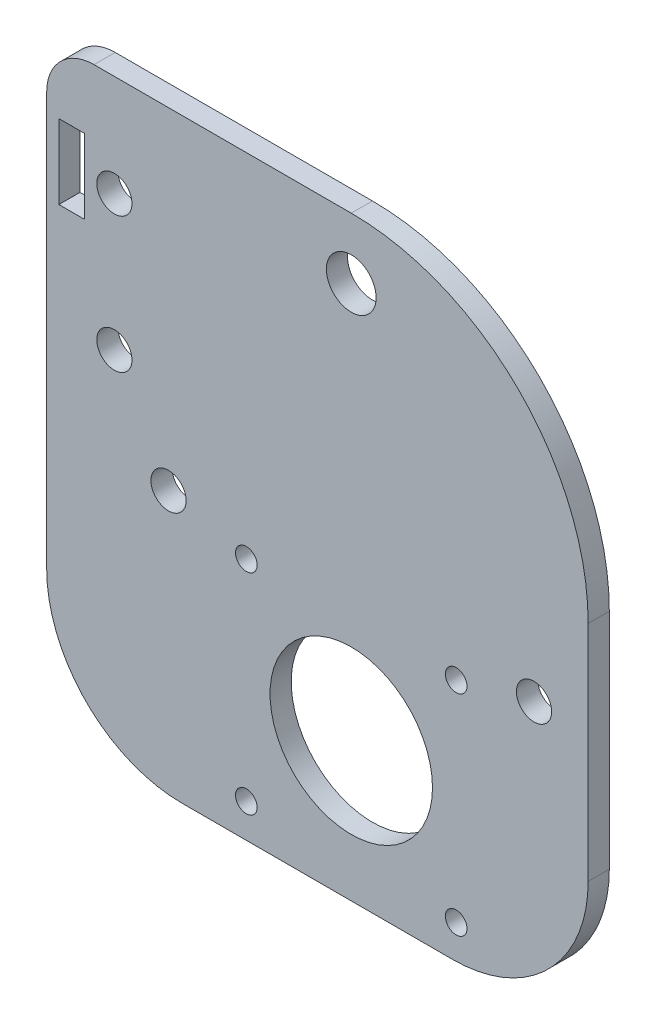
ISO-10303-21;
HEADER;
FILE_DESCRIPTION(('STEP AP214'),'2;1');
FILE_NAME('part.step','',(''),(''),'','','');
FILE_SCHEMA(('AUTOMOTIVE_DESIGN { 1 0 10303 214 1 1 1 1 }'));
ENDSEC;
DATA;
#1=APPLICATION_CONTEXT('core data for automotive mechanical design processes');
#2=APPLICATION_PROTOCOL_DEFINITION('international standard','automotive_design',2000,#1);
#3=PRODUCT_CONTEXT('',#1,'mechanical');
#4=PRODUCT('Part','Part','',(#3));
#5=PRODUCT_RELATED_PRODUCT_CATEGORY('part','',(#4));
#6=PRODUCT_DEFINITION_FORMATION('','',#4);
#7=PRODUCT_DEFINITION_CONTEXT('part definition',#1,'design');
#8=PRODUCT_DEFINITION('design','',#6,#7);
#9=PRODUCT_DEFINITION_SHAPE('','',#8);
#10=(LENGTH_UNIT() NAMED_UNIT(*) SI_UNIT(.MILLI.,.METRE.));
#11=(NAMED_UNIT(*) PLANE_ANGLE_UNIT() SI_UNIT($,.RADIAN.));
#12=(NAMED_UNIT(*) SI_UNIT($,.STERADIAN.) SOLID_ANGLE_UNIT());
#13=UNCERTAINTY_MEASURE_WITH_UNIT(LENGTH_MEASURE(1.E-05),#10,'distance_accuracy_value','');
#14=(GEOMETRIC_REPRESENTATION_CONTEXT(3) GLOBAL_UNCERTAINTY_ASSIGNED_CONTEXT((#13)) GLOBAL_UNIT_ASSIGNED_CONTEXT((#10,
#11,#12)) REPRESENTATION_CONTEXT('',''));
#15=CARTESIAN_POINT('',(0.,0.,0.));
#16=DIRECTION('',(0.,0.,1.));
#17=DIRECTION('',(1.,0.,0.));
#18=AXIS2_PLACEMENT_3D('',#15,#16,#17);
#19=CARTESIAN_POINT('',(45.,53.,3.125));
#20=DIRECTION('',(0.,0.,1.));
#21=DIRECTION('',(1.,0.,0.));
#22=AXIS2_PLACEMENT_3D('',#19,#20,#21);
#23=PLANE('',#22);
#24=CARTESIAN_POINT('',(72.,39.,3.125));
#25=DIRECTION('',(0.,0.,1.));
#26=DIRECTION('',(1.,0.,0.));
#27=AXIS2_PLACEMENT_3D('',#24,#25,#26);
#28=CIRCLE('',#27,2.60000000000002);
#29=CARTESIAN_POINT('',(74.6,39.,3.125));
#30=VERTEX_POINT('',#29);
#31=EDGE_CURVE('E159',#30,#30,#28,.T.);
#32=ORIENTED_EDGE('',*,*,#31,.F.);
#33=EDGE_LOOP('',(#32));
#34=FACE_BOUND('',#33,.T.);
#35=CARTESIAN_POINT('',(29.5,36.,3.125));
#36=DIRECTION('',(0.,0.,1.));
#37=DIRECTION('',(1.,0.,0.));
#38=AXIS2_PLACEMENT_3D('',#35,#36,#37);
#39=CIRCLE('',#38,1.59999999999999);
#40=CARTESIAN_POINT('',(31.1,36.,3.125));
#41=VERTEX_POINT('',#40);
#42=EDGE_CURVE('E171',#41,#41,#39,.T.);
#43=ORIENTED_EDGE('',*,*,#42,.F.);
#44=EDGE_LOOP('',(#43));
#45=FACE_BOUND('',#44,.T.);
#46=CARTESIAN_POINT('',(45.,79.,3.125));
#47=DIRECTION('',(0.,0.,1.));
#48=DIRECTION('',(1.,0.,0.));
#49=AXIS2_PLACEMENT_3D('',#46,#47,#48);
#50=CIRCLE('',#49,3.675);
#51=CARTESIAN_POINT('',(48.675,79.,3.125));
#52=VERTEX_POINT('',#51);
#53=EDGE_CURVE('E183',#52,#52,#50,.T.);
#54=ORIENTED_EDGE('',*,*,#53,.F.);
#55=EDGE_LOOP('',(#54));
#56=FACE_BOUND('',#55,.T.);
#57=CARTESIAN_POINT('',(60.5,36.,3.125));
#58=DIRECTION('',(0.,0.,1.));
#59=DIRECTION('',(1.,0.,0.));
#60=AXIS2_PLACEMENT_3D('',#57,#58,#59);
#61=CIRCLE('',#60,1.59999999999998);
#62=CARTESIAN_POINT('',(62.1,36.,3.125));
#63=VERTEX_POINT('',#62);
#64=EDGE_CURVE('E195',#63,#63,#61,.T.);
#65=ORIENTED_EDGE('',*,*,#64,.F.);
#66=EDGE_LOOP('',(#65));
#67=FACE_BOUND('',#66,.T.);
#68=CARTESIAN_POINT('',(45.,20.5,3.125));
#69=DIRECTION('',(0.,0.,1.));
#70=DIRECTION('',(1.,0.,0.));
#71=AXIS2_PLACEMENT_3D('',#68,#69,#70);
#72=CIRCLE('',#71,12.);
#73=CARTESIAN_POINT('',(57.,20.5,3.125));
#74=VERTEX_POINT('',#73);
#75=EDGE_CURVE('E207',#74,#74,#72,.T.);
#76=ORIENTED_EDGE('',*,*,#75,.F.);
#77=EDGE_LOOP('',(#76));
#78=FACE_BOUND('',#77,.T.);
#79=CARTESIAN_POINT('',(45.,53.,3.125));
#80=DIRECTION('',(0.,0.,1.));
#81=DIRECTION('',(1.,0.,0.));
#82=AXIS2_PLACEMENT_3D('',#79,#80,#81);
#83=CIRCLE('',#82,35.);
#84=CARTESIAN_POINT('',(80.,53.,3.125));
#85=VERTEX_POINT('',#84);
#86=CARTESIAN_POINT('',(45.,88.,3.125));
#87=VERTEX_POINT('',#86);
#88=EDGE_CURVE('E219',#85,#87,#83,.T.);
#89=ORIENTED_EDGE('',*,*,#88,.T.);
#90=DIRECTION('',(-1.,0.,0.));
#91=VECTOR('',#90,1.);
#92=CARTESIAN_POINT('',(45.,88.,3.125));
#93=LINE('',#92,#91);
#94=CARTESIAN_POINT('',(7.,88.,3.125));
#95=VERTEX_POINT('',#94);
#96=EDGE_CURVE('E222',#87,#95,#93,.T.);
#97=ORIENTED_EDGE('',*,*,#96,.T.);
#98=CARTESIAN_POINT('',(7.,81.,3.125));
#99=DIRECTION('',(0.,0.,1.));
#100=DIRECTION('',(1.,0.,0.));
#101=AXIS2_PLACEMENT_3D('',#98,#99,#100);
#102=CIRCLE('',#101,7.);
#103=CARTESIAN_POINT('',(0.,81.,3.125));
#104=VERTEX_POINT('',#103);
#105=EDGE_CURVE('E225',#95,#104,#102,.T.);
#106=ORIENTED_EDGE('',*,*,#105,.T.);
#107=DIRECTION('',(0.,-1.,0.));
#108=VECTOR('',#107,1.);
#109=CARTESIAN_POINT('',(0.,81.,3.125));
#110=LINE('',#109,#108);
#111=CARTESIAN_POINT('',(0.,20.,3.125));
#112=VERTEX_POINT('',#111);
#113=EDGE_CURVE('E227',#104,#112,#110,.T.);
#114=ORIENTED_EDGE('',*,*,#113,.T.);
#115=CARTESIAN_POINT('',(20.,20.,3.125));
#116=DIRECTION('',(0.,0.,1.));
#117=DIRECTION('',(1.,0.,0.));
#118=AXIS2_PLACEMENT_3D('',#115,#116,#117);
#119=CIRCLE('',#118,20.);
#120=CARTESIAN_POINT('',(20.,0.,3.125));
#121=VERTEX_POINT('',#120);
#122=EDGE_CURVE('E229',#112,#121,#119,.T.);
#123=ORIENTED_EDGE('',*,*,#122,.T.);
#124=DIRECTION('',(1.,0.,0.));
#125=VECTOR('',#124,1.);
#126=CARTESIAN_POINT('',(20.,0.,3.125));
#127=LINE('',#126,#125);
#128=CARTESIAN_POINT('',(60.,0.,3.125));
#129=VERTEX_POINT('',#128);
#130=EDGE_CURVE('E231',#121,#129,#127,.T.);
#131=ORIENTED_EDGE('',*,*,#130,.T.);
#132=CARTESIAN_POINT('',(60.,20.,3.125));
#133=DIRECTION('',(0.,0.,1.));
#134=DIRECTION('',(1.,0.,0.));
#135=AXIS2_PLACEMENT_3D('',#132,#133,#134);
#136=CIRCLE('',#135,20.);
#137=CARTESIAN_POINT('',(80.,20.,3.125));
#138=VERTEX_POINT('',#137);
#139=EDGE_CURVE('E233',#129,#138,#136,.T.);
#140=ORIENTED_EDGE('',*,*,#139,.T.);
#141=DIRECTION('',(0.,1.,0.));
#142=VECTOR('',#141,1.);
#143=CARTESIAN_POINT('',(80.,20.,3.125));
#144=LINE('',#143,#142);
#145=EDGE_CURVE('E235',#138,#85,#144,.T.);
#146=ORIENTED_EDGE('',*,*,#145,.T.);
#147=EDGE_LOOP('',(#89,#97,#106,#114,#123,#131,#140,#146));
#148=FACE_BOUND('',#147,.T.);
#149=CARTESIAN_POINT('',(10.,73.,3.125));
#150=DIRECTION('',(0.,0.,1.));
#151=DIRECTION('',(1.,0.,0.));
#152=AXIS2_PLACEMENT_3D('',#149,#150,#151);
#153=CIRCLE('',#152,2.60000000000004);
#154=CARTESIAN_POINT('',(12.6,73.,3.125));
#155=VERTEX_POINT('',#154);
#156=EDGE_CURVE('E213',#155,#155,#153,.T.);
#157=ORIENTED_EDGE('',*,*,#156,.F.);
#158=EDGE_LOOP('',(#157));
#159=FACE_BOUND('',#158,.T.);
#160=CARTESIAN_POINT('',(18.,39.,3.125));
#161=DIRECTION('',(0.,0.,1.));
#162=DIRECTION('',(1.,0.,0.));
#163=AXIS2_PLACEMENT_3D('',#160,#161,#162);
#164=CIRCLE('',#163,2.59999999999999);
#165=CARTESIAN_POINT('',(20.6,39.,3.125));
#166=VERTEX_POINT('',#165);
#167=EDGE_CURVE('E201',#166,#166,#164,.T.);
#168=ORIENTED_EDGE('',*,*,#167,.F.);
#169=EDGE_LOOP('',(#168));
#170=FACE_BOUND('',#169,.T.);
#171=CARTESIAN_POINT('',(29.5,5.,3.125));
#172=DIRECTION('',(0.,0.,1.));
#173=DIRECTION('',(1.,0.,0.));
#174=AXIS2_PLACEMENT_3D('',#171,#172,#173);
#175=CIRCLE('',#174,1.6);
#176=CARTESIAN_POINT('',(31.1,5.,3.125));
#177=VERTEX_POINT('',#176);
#178=EDGE_CURVE('E189',#177,#177,#175,.T.);
#179=ORIENTED_EDGE('',*,*,#178,.F.);
#180=EDGE_LOOP('',(#179));
#181=FACE_BOUND('',#180,.T.);
#182=CARTESIAN_POINT('',(10.,53.,3.125));
#183=DIRECTION('',(0.,0.,1.));
#184=DIRECTION('',(1.,0.,0.));
#185=AXIS2_PLACEMENT_3D('',#182,#183,#184);
#186=CIRCLE('',#185,2.59999999999998);
#187=CARTESIAN_POINT('',(12.6,53.,3.125));
#188=VERTEX_POINT('',#187);
#189=EDGE_CURVE('E177',#188,#188,#186,.T.);
#190=ORIENTED_EDGE('',*,*,#189,.F.);
#191=EDGE_LOOP('',(#190));
#192=FACE_BOUND('',#191,.T.);
#193=CARTESIAN_POINT('',(60.5,5.,3.125));
#194=DIRECTION('',(0.,0.,1.));
#195=DIRECTION('',(1.,0.,0.));
#196=AXIS2_PLACEMENT_3D('',#193,#194,#195);
#197=CIRCLE('',#196,1.59999999999999);
#198=CARTESIAN_POINT('',(62.1,5.,3.125));
#199=VERTEX_POINT('',#198);
#200=EDGE_CURVE('E165',#199,#199,#197,.T.);
#201=ORIENTED_EDGE('',*,*,#200,.F.);
#202=EDGE_LOOP('',(#201));
#203=FACE_BOUND('',#202,.T.);
#204=DIRECTION('',(0.,-1.,0.));
#205=VECTOR('',#204,1.);
#206=CARTESIAN_POINT('',(1.8,78.5,3.125));
#207=LINE('',#206,#205);
#208=CARTESIAN_POINT('',(1.8,78.5,3.125));
#209=VERTEX_POINT('',#208);
#210=CARTESIAN_POINT('',(1.8,67.5,3.125));
#211=VERTEX_POINT('',#210);
#212=EDGE_CURVE('E131',#209,#211,#207,.T.);
#213=ORIENTED_EDGE('',*,*,#212,.F.);
#214=DIRECTION('',(-1.,0.,0.));
#215=VECTOR('',#214,1.);
#216=CARTESIAN_POINT('',(5.5606601718,78.5,3.125));
#217=LINE('',#216,#215);
#218=CARTESIAN_POINT('',(5.5606601718,78.5,3.125));
#219=VERTEX_POINT('',#218);
#220=EDGE_CURVE('E123',#219,#209,#217,.T.);
#221=ORIENTED_EDGE('',*,*,#220,.F.);
#222=DIRECTION('',(0.,1.,0.));
#223=VECTOR('',#222,1.);
#224=CARTESIAN_POINT('',(5.5606601718,67.5,3.125));
#225=LINE('',#224,#223);
#226=CARTESIAN_POINT('',(5.5606601718,67.5,3.125));
#227=VERTEX_POINT('',#226);
#228=EDGE_CURVE('E145',#227,#219,#225,.T.);
#229=ORIENTED_EDGE('',*,*,#228,.F.);
#230=DIRECTION('',(1.,0.,0.));
#231=VECTOR('',#230,1.);
#232=CARTESIAN_POINT('',(1.8,67.5,3.125));
#233=LINE('',#232,#231);
#234=EDGE_CURVE('E143',#211,#227,#233,.T.);
#235=ORIENTED_EDGE('',*,*,#234,.F.);
#236=EDGE_LOOP('',(#213,#221,#229,#235));
#237=FACE_BOUND('',#236,.T.);
#238=ADVANCED_FACE('F34',(#34,#45,#56,#67,#78,#148,#159,#170,#181,#192,#203,#237),#23,.T.);
#239=CARTESIAN_POINT('',(45.,53.,0.));
#240=DIRECTION('',(0.,0.,1.));
#241=DIRECTION('',(1.,0.,0.));
#242=AXIS2_PLACEMENT_3D('',#239,#240,#241);
#243=PLANE('',#242);
#244=CARTESIAN_POINT('',(72.,39.,0.));
#245=DIRECTION('',(0.,0.,1.));
#246=DIRECTION('',(1.,0.,0.));
#247=AXIS2_PLACEMENT_3D('',#244,#245,#246);
#248=CIRCLE('',#247,2.60000000000002);
#249=CARTESIAN_POINT('',(74.6,39.,0.));
#250=VERTEX_POINT('',#249);
#251=EDGE_CURVE('E139',#250,#250,#248,.T.);
#252=ORIENTED_EDGE('',*,*,#251,.T.);
#253=EDGE_LOOP('',(#252));
#254=FACE_BOUND('',#253,.T.);
#255=CARTESIAN_POINT('',(29.5,36.,0.));
#256=DIRECTION('',(0.,0.,1.));
#257=DIRECTION('',(1.,0.,0.));
#258=AXIS2_PLACEMENT_3D('',#255,#256,#257);
#259=CIRCLE('',#258,1.59999999999999);
#260=CARTESIAN_POINT('',(31.1,36.,0.));
#261=VERTEX_POINT('',#260);
#262=EDGE_CURVE('E168',#261,#261,#259,.T.);
#263=ORIENTED_EDGE('',*,*,#262,.T.);
#264=EDGE_LOOP('',(#263));
#265=FACE_BOUND('',#264,.T.);
#266=CARTESIAN_POINT('',(45.,79.,0.));
#267=DIRECTION('',(0.,0.,1.));
#268=DIRECTION('',(1.,0.,0.));
#269=AXIS2_PLACEMENT_3D('',#266,#267,#268);
#270=CIRCLE('',#269,3.675);
#271=CARTESIAN_POINT('',(48.675,79.,0.));
#272=VERTEX_POINT('',#271);
#273=EDGE_CURVE('E180',#272,#272,#270,.T.);
#274=ORIENTED_EDGE('',*,*,#273,.T.);
#275=EDGE_LOOP('',(#274));
#276=FACE_BOUND('',#275,.T.);
#277=CARTESIAN_POINT('',(60.5,36.,0.));
#278=DIRECTION('',(0.,0.,1.));
#279=DIRECTION('',(1.,0.,0.));
#280=AXIS2_PLACEMENT_3D('',#277,#278,#279);
#281=CIRCLE('',#280,1.59999999999998);
#282=CARTESIAN_POINT('',(62.1,36.,0.));
#283=VERTEX_POINT('',#282);
#284=EDGE_CURVE('E192',#283,#283,#281,.T.);
#285=ORIENTED_EDGE('',*,*,#284,.T.);
#286=EDGE_LOOP('',(#285));
#287=FACE_BOUND('',#286,.T.);
#288=CARTESIAN_POINT('',(45.,20.5,0.));
#289=DIRECTION('',(0.,0.,1.));
#290=DIRECTION('',(1.,0.,0.));
#291=AXIS2_PLACEMENT_3D('',#288,#289,#290);
#292=CIRCLE('',#291,12.);
#293=CARTESIAN_POINT('',(57.,20.5,0.));
#294=VERTEX_POINT('',#293);
#295=EDGE_CURVE('E204',#294,#294,#292,.T.);
#296=ORIENTED_EDGE('',*,*,#295,.T.);
#297=EDGE_LOOP('',(#296));
#298=FACE_BOUND('',#297,.T.);
#299=CARTESIAN_POINT('',(45.,53.,0.));
#300=DIRECTION('',(0.,0.,1.));
#301=DIRECTION('',(1.,0.,0.));
#302=AXIS2_PLACEMENT_3D('',#299,#300,#301);
#303=CIRCLE('',#302,35.);
#304=CARTESIAN_POINT('',(80.,53.,0.));
#305=VERTEX_POINT('',#304);
#306=CARTESIAN_POINT('',(45.,88.,0.));
#307=VERTEX_POINT('',#306);
#308=EDGE_CURVE('E216',#305,#307,#303,.T.);
#309=ORIENTED_EDGE('',*,*,#308,.F.);
#310=DIRECTION('',(0.,1.,0.));
#311=VECTOR('',#310,1.);
#312=CARTESIAN_POINT('',(80.,20.,0.));
#313=LINE('',#312,#311);
#314=CARTESIAN_POINT('',(80.,20.,0.));
#315=VERTEX_POINT('',#314);
#316=EDGE_CURVE('E223',#315,#305,#313,.T.);
#317=ORIENTED_EDGE('',*,*,#316,.F.);
#318=CARTESIAN_POINT('',(60.,20.,0.));
#319=DIRECTION('',(0.,0.,1.));
#320=DIRECTION('',(1.,0.,0.));
#321=AXIS2_PLACEMENT_3D('',#318,#319,#320);
#322=CIRCLE('',#321,20.);
#323=CARTESIAN_POINT('',(60.,0.,0.));
#324=VERTEX_POINT('',#323);
#325=EDGE_CURVE('E250',#324,#315,#322,.T.);
#326=ORIENTED_EDGE('',*,*,#325,.F.);
#327=DIRECTION('',(1.,0.,0.));
#328=VECTOR('',#327,1.);
#329=CARTESIAN_POINT('',(20.,0.,0.));
#330=LINE('',#329,#328);
#331=CARTESIAN_POINT('',(20.,0.,0.));
#332=VERTEX_POINT('',#331);
#333=EDGE_CURVE('E248',#332,#324,#330,.T.);
#334=ORIENTED_EDGE('',*,*,#333,.F.);
#335=CARTESIAN_POINT('',(20.,20.,0.));
#336=DIRECTION('',(0.,0.,1.));
#337=DIRECTION('',(1.,0.,0.));
#338=AXIS2_PLACEMENT_3D('',#335,#336,#337);
#339=CIRCLE('',#338,20.);
#340=CARTESIAN_POINT('',(0.,20.,0.));
#341=VERTEX_POINT('',#340);
#342=EDGE_CURVE('E246',#341,#332,#339,.T.);
#343=ORIENTED_EDGE('',*,*,#342,.F.);
#344=DIRECTION('',(0.,-1.,0.));
#345=VECTOR('',#344,1.);
#346=CARTESIAN_POINT('',(0.,81.,0.));
#347=LINE('',#346,#345);
#348=CARTESIAN_POINT('',(0.,81.,0.));
#349=VERTEX_POINT('',#348);
#350=EDGE_CURVE('E244',#349,#341,#347,.T.);
#351=ORIENTED_EDGE('',*,*,#350,.F.);
#352=CARTESIAN_POINT('',(7.,81.,0.));
#353=DIRECTION('',(0.,0.,1.));
#354=DIRECTION('',(1.,0.,0.));
#355=AXIS2_PLACEMENT_3D('',#352,#353,#354);
#356=CIRCLE('',#355,7.);
#357=CARTESIAN_POINT('',(7.,88.,0.));
#358=VERTEX_POINT('',#357);
#359=EDGE_CURVE('E242',#358,#349,#356,.T.);
#360=ORIENTED_EDGE('',*,*,#359,.F.);
#361=DIRECTION('',(-1.,0.,0.));
#362=VECTOR('',#361,1.);
#363=CARTESIAN_POINT('',(45.,88.,0.));
#364=LINE('',#363,#362);
#365=EDGE_CURVE('E240',#307,#358,#364,.T.);
#366=ORIENTED_EDGE('',*,*,#365,.F.);
#367=EDGE_LOOP('',(#309,#317,#326,#334,#343,#351,#360,#366));
#368=FACE_BOUND('',#367,.T.);
#369=CARTESIAN_POINT('',(10.,73.,0.));
#370=DIRECTION('',(0.,0.,1.));
#371=DIRECTION('',(1.,0.,0.));
#372=AXIS2_PLACEMENT_3D('',#369,#370,#371);
#373=CIRCLE('',#372,2.60000000000004);
#374=CARTESIAN_POINT('',(12.6,73.,0.));
#375=VERTEX_POINT('',#374);
#376=EDGE_CURVE('E210',#375,#375,#373,.T.);
#377=ORIENTED_EDGE('',*,*,#376,.T.);
#378=EDGE_LOOP('',(#377));
#379=FACE_BOUND('',#378,.T.);
#380=CARTESIAN_POINT('',(18.,39.,0.));
#381=DIRECTION('',(0.,0.,1.));
#382=DIRECTION('',(1.,0.,0.));
#383=AXIS2_PLACEMENT_3D('',#380,#381,#382);
#384=CIRCLE('',#383,2.59999999999999);
#385=CARTESIAN_POINT('',(20.6,39.,0.));
#386=VERTEX_POINT('',#385);
#387=EDGE_CURVE('E198',#386,#386,#384,.T.);
#388=ORIENTED_EDGE('',*,*,#387,.T.);
#389=EDGE_LOOP('',(#388));
#390=FACE_BOUND('',#389,.T.);
#391=CARTESIAN_POINT('',(29.5,5.,0.));
#392=DIRECTION('',(0.,0.,1.));
#393=DIRECTION('',(1.,0.,0.));
#394=AXIS2_PLACEMENT_3D('',#391,#392,#393);
#395=CIRCLE('',#394,1.6);
#396=CARTESIAN_POINT('',(31.1,5.,0.));
#397=VERTEX_POINT('',#396);
#398=EDGE_CURVE('E186',#397,#397,#395,.T.);
#399=ORIENTED_EDGE('',*,*,#398,.T.);
#400=EDGE_LOOP('',(#399));
#401=FACE_BOUND('',#400,.T.);
#402=CARTESIAN_POINT('',(10.,53.,0.));
#403=DIRECTION('',(0.,0.,1.));
#404=DIRECTION('',(1.,0.,0.));
#405=AXIS2_PLACEMENT_3D('',#402,#403,#404);
#406=CIRCLE('',#405,2.59999999999998);
#407=CARTESIAN_POINT('',(12.6,53.,0.));
#408=VERTEX_POINT('',#407);
#409=EDGE_CURVE('E174',#408,#408,#406,.T.);
#410=ORIENTED_EDGE('',*,*,#409,.T.);
#411=EDGE_LOOP('',(#410));
#412=FACE_BOUND('',#411,.T.);
#413=CARTESIAN_POINT('',(60.5,5.,0.));
#414=DIRECTION('',(0.,0.,1.));
#415=DIRECTION('',(1.,0.,0.));
#416=AXIS2_PLACEMENT_3D('',#413,#414,#415);
#417=CIRCLE('',#416,1.59999999999999);
#418=CARTESIAN_POINT('',(62.1,5.,0.));
#419=VERTEX_POINT('',#418);
#420=EDGE_CURVE('E162',#419,#419,#417,.T.);
#421=ORIENTED_EDGE('',*,*,#420,.T.);
#422=EDGE_LOOP('',(#421));
#423=FACE_BOUND('',#422,.T.);
#424=DIRECTION('',(-1.,0.,0.));
#425=VECTOR('',#424,1.);
#426=CARTESIAN_POINT('',(5.5606601718,78.5,0.));
#427=LINE('',#426,#425);
#428=CARTESIAN_POINT('',(5.5606601718,78.5,0.));
#429=VERTEX_POINT('',#428);
#430=CARTESIAN_POINT('',(1.8,78.5,0.));
#431=VERTEX_POINT('',#430);
#432=EDGE_CURVE('E57',#429,#431,#427,.T.);
#433=ORIENTED_EDGE('',*,*,#432,.T.);
#434=DIRECTION('',(0.,-1.,0.));
#435=VECTOR('',#434,1.);
#436=CARTESIAN_POINT('',(1.8,78.5,0.));
#437=LINE('',#436,#435);
#438=CARTESIAN_POINT('',(1.8,67.5,0.));
#439=VERTEX_POINT('',#438);
#440=EDGE_CURVE('E138',#431,#439,#437,.T.);
#441=ORIENTED_EDGE('',*,*,#440,.T.);
#442=DIRECTION('',(1.,0.,0.));
#443=VECTOR('',#442,1.);
#444=CARTESIAN_POINT('',(1.8,67.5,0.));
#445=LINE('',#444,#443);
#446=CARTESIAN_POINT('',(5.5606601718,67.5,0.));
#447=VERTEX_POINT('',#446);
#448=EDGE_CURVE('E151',#439,#447,#445,.T.);
#449=ORIENTED_EDGE('',*,*,#448,.T.);
#450=DIRECTION('',(0.,1.,0.));
#451=VECTOR('',#450,1.);
#452=CARTESIAN_POINT('',(5.5606601718,67.5,0.));
#453=LINE('',#452,#451);
#454=EDGE_CURVE('E132',#447,#429,#453,.T.);
#455=ORIENTED_EDGE('',*,*,#454,.T.);
#456=EDGE_LOOP('',(#433,#441,#449,#455));
#457=FACE_BOUND('',#456,.T.);
#458=ADVANCED_FACE('F280',(#254,#265,#276,#287,#298,#368,#379,#390,#401,#412,#423,#457),#243,.F.);
#459=CARTESIAN_POINT('',(45.,53.,3.125));
#460=DIRECTION('',(0.,0.,-1.));
#461=DIRECTION('',(-1.,0.,0.));
#462=AXIS2_PLACEMENT_3D('',#459,#460,#461);
#463=CYLINDRICAL_SURFACE('',#462,35.);
#464=ORIENTED_EDGE('',*,*,#308,.T.);
#465=DIRECTION('',(0.,0.,-1.));
#466=VECTOR('',#465,1.);
#467=CARTESIAN_POINT('',(45.,88.,3.125));
#468=LINE('',#467,#466);
#469=EDGE_CURVE('E11',#87,#307,#468,.T.);
#470=ORIENTED_EDGE('',*,*,#469,.F.);
#471=ORIENTED_EDGE('',*,*,#88,.F.);
#472=DIRECTION('',(0.,0.,-1.));
#473=VECTOR('',#472,1.);
#474=CARTESIAN_POINT('',(80.,53.,3.125));
#475=LINE('',#474,#473);
#476=EDGE_CURVE('E237',#85,#305,#475,.T.);
#477=ORIENTED_EDGE('',*,*,#476,.T.);
#478=EDGE_LOOP('',(#464,#470,#471,#477));
#479=FACE_BOUND('',#478,.T.);
#480=ADVANCED_FACE('F36',(#479),#463,.T.);
#481=CARTESIAN_POINT('',(45.,88.,3.125));
#482=DIRECTION('',(0.,-1.,0.));
#483=DIRECTION('',(0.,0.,-1.));
#484=AXIS2_PLACEMENT_3D('',#481,#482,#483);
#485=PLANE('',#484);
#486=ORIENTED_EDGE('',*,*,#365,.T.);
#487=DIRECTION('',(0.,0.,-1.));
#488=VECTOR('',#487,1.);
#489=CARTESIAN_POINT('',(7.,88.,3.125));
#490=LINE('',#489,#488);
#491=EDGE_CURVE('E42',#95,#358,#490,.T.);
#492=ORIENTED_EDGE('',*,*,#491,.F.);
#493=ORIENTED_EDGE('',*,*,#96,.F.);
#494=ORIENTED_EDGE('',*,*,#469,.T.);
#495=EDGE_LOOP('',(#486,#492,#493,#494));
#496=FACE_BOUND('',#495,.T.);
#497=ADVANCED_FACE('F298',(#496),#485,.F.);
#498=CARTESIAN_POINT('',(7.,81.,3.125));
#499=DIRECTION('',(0.,0.,-1.));
#500=DIRECTION('',(-1.,0.,0.));
#501=AXIS2_PLACEMENT_3D('',#498,#499,#500);
#502=CYLINDRICAL_SURFACE('',#501,7.);
#503=ORIENTED_EDGE('',*,*,#359,.T.);
#504=DIRECTION('',(0.,0.,-1.));
#505=VECTOR('',#504,1.);
#506=CARTESIAN_POINT('',(0.,81.,3.125));
#507=LINE('',#506,#505);
#508=EDGE_CURVE('E267',#104,#349,#507,.T.);
#509=ORIENTED_EDGE('',*,*,#508,.F.);
#510=ORIENTED_EDGE('',*,*,#105,.F.);
#511=ORIENTED_EDGE('',*,*,#491,.T.);
#512=EDGE_LOOP('',(#503,#509,#510,#511));
#513=FACE_BOUND('',#512,.T.);
#514=ADVANCED_FACE('F274',(#513),#502,.T.);
#515=CARTESIAN_POINT('',(0.,81.,3.125));
#516=DIRECTION('',(1.,0.,0.));
#517=DIRECTION('',(0.,0.,-1.));
#518=AXIS2_PLACEMENT_3D('',#515,#516,#517);
#519=PLANE('',#518);
#520=ORIENTED_EDGE('',*,*,#350,.T.);
#521=DIRECTION('',(0.,0.,-1.));
#522=VECTOR('',#521,1.);
#523=CARTESIAN_POINT('',(0.,20.,3.125));
#524=LINE('',#523,#522);
#525=EDGE_CURVE('E264',#112,#341,#524,.T.);
#526=ORIENTED_EDGE('',*,*,#525,.F.);
#527=ORIENTED_EDGE('',*,*,#113,.F.);
#528=ORIENTED_EDGE('',*,*,#508,.T.);
#529=EDGE_LOOP('',(#520,#526,#527,#528));
#530=FACE_BOUND('',#529,.T.);
#531=ADVANCED_FACE('F286',(#530),#519,.F.);
#532=CARTESIAN_POINT('',(20.,20.,3.125));
#533=DIRECTION('',(0.,0.,-1.));
#534=DIRECTION('',(-1.,0.,0.));
#535=AXIS2_PLACEMENT_3D('',#532,#533,#534);
#536=CYLINDRICAL_SURFACE('',#535,20.);
#537=ORIENTED_EDGE('',*,*,#342,.T.);
#538=DIRECTION('',(0.,0.,-1.));
#539=VECTOR('',#538,1.);
#540=CARTESIAN_POINT('',(20.,0.,3.125));
#541=LINE('',#540,#539);
#542=EDGE_CURVE('E261',#121,#332,#541,.T.);
#543=ORIENTED_EDGE('',*,*,#542,.F.);
#544=ORIENTED_EDGE('',*,*,#122,.F.);
#545=ORIENTED_EDGE('',*,*,#525,.T.);
#546=EDGE_LOOP('',(#537,#543,#544,#545));
#547=FACE_BOUND('',#546,.T.);
#548=ADVANCED_FACE('F290',(#547),#536,.T.);
#549=CARTESIAN_POINT('',(20.,0.,3.125));
#550=DIRECTION('',(0.,1.,0.));
#551=DIRECTION('',(0.,0.,1.));
#552=AXIS2_PLACEMENT_3D('',#549,#550,#551);
#553=PLANE('',#552);
#554=ORIENTED_EDGE('',*,*,#333,.T.);
#555=DIRECTION('',(0.,0.,-1.));
#556=VECTOR('',#555,1.);
#557=CARTESIAN_POINT('',(60.,0.,3.125));
#558=LINE('',#557,#556);
#559=EDGE_CURVE('E258',#129,#324,#558,.T.);
#560=ORIENTED_EDGE('',*,*,#559,.F.);
#561=ORIENTED_EDGE('',*,*,#130,.F.);
#562=ORIENTED_EDGE('',*,*,#542,.T.);
#563=EDGE_LOOP('',(#554,#560,#561,#562));
#564=FACE_BOUND('',#563,.T.);
#565=ADVANCED_FACE('F311',(#564),#553,.F.);
#566=CARTESIAN_POINT('',(60.,20.,3.125));
#567=DIRECTION('',(0.,0.,-1.));
#568=DIRECTION('',(-1.,0.,0.));
#569=AXIS2_PLACEMENT_3D('',#566,#567,#568);
#570=CYLINDRICAL_SURFACE('',#569,20.);
#571=ORIENTED_EDGE('',*,*,#325,.T.);
#572=DIRECTION('',(0.,0.,-1.));
#573=VECTOR('',#572,1.);
#574=CARTESIAN_POINT('',(80.,20.,3.125));
#575=LINE('',#574,#573);
#576=EDGE_CURVE('E255',#138,#315,#575,.T.);
#577=ORIENTED_EDGE('',*,*,#576,.F.);
#578=ORIENTED_EDGE('',*,*,#139,.F.);
#579=ORIENTED_EDGE('',*,*,#559,.T.);
#580=EDGE_LOOP('',(#571,#577,#578,#579));
#581=FACE_BOUND('',#580,.T.);
#582=ADVANCED_FACE('F309',(#581),#570,.T.);
#583=CARTESIAN_POINT('',(80.,20.,3.125));
#584=DIRECTION('',(-1.,0.,0.));
#585=DIRECTION('',(0.,0.,1.));
#586=AXIS2_PLACEMENT_3D('',#583,#584,#585);
#587=PLANE('',#586);
#588=ORIENTED_EDGE('',*,*,#316,.T.);
#589=ORIENTED_EDGE('',*,*,#476,.F.);
#590=ORIENTED_EDGE('',*,*,#145,.F.);
#591=ORIENTED_EDGE('',*,*,#576,.T.);
#592=EDGE_LOOP('',(#588,#589,#590,#591));
#593=FACE_BOUND('',#592,.T.);
#594=ADVANCED_FACE('F304',(#593),#587,.F.);
#595=CARTESIAN_POINT('',(10.,73.,3.125));
#596=DIRECTION('',(0.,0.,-1.));
#597=DIRECTION('',(-1.,0.,0.));
#598=AXIS2_PLACEMENT_3D('',#595,#596,#597);
#599=CYLINDRICAL_SURFACE('',#598,2.60000000000004);
#600=ORIENTED_EDGE('',*,*,#156,.T.);
#601=EDGE_LOOP('',(#600));
#602=FACE_BOUND('',#601,.T.);
#603=ORIENTED_EDGE('',*,*,#376,.F.);
#604=EDGE_LOOP('',(#603));
#605=FACE_BOUND('',#604,.T.);
#606=ADVANCED_FACE('F331',(#602,#605),#599,.F.);
#607=CARTESIAN_POINT('',(45.,20.5,3.125));
#608=DIRECTION('',(0.,0.,-1.));
#609=DIRECTION('',(-1.,0.,0.));
#610=AXIS2_PLACEMENT_3D('',#607,#608,#609);
#611=CYLINDRICAL_SURFACE('',#610,12.);
#612=ORIENTED_EDGE('',*,*,#75,.T.);
#613=EDGE_LOOP('',(#612));
#614=FACE_BOUND('',#613,.T.);
#615=ORIENTED_EDGE('',*,*,#295,.F.);
#616=EDGE_LOOP('',(#615));
#617=FACE_BOUND('',#616,.T.);
#618=ADVANCED_FACE('F338',(#614,#617),#611,.F.);
#619=CARTESIAN_POINT('',(18.,39.,3.125));
#620=DIRECTION('',(0.,0.,-1.));
#621=DIRECTION('',(-1.,0.,0.));
#622=AXIS2_PLACEMENT_3D('',#619,#620,#621);
#623=CYLINDRICAL_SURFACE('',#622,2.59999999999999);
#624=ORIENTED_EDGE('',*,*,#167,.T.);
#625=EDGE_LOOP('',(#624));
#626=FACE_BOUND('',#625,.T.);
#627=ORIENTED_EDGE('',*,*,#387,.F.);
#628=EDGE_LOOP('',(#627));
#629=FACE_BOUND('',#628,.T.);
#630=ADVANCED_FACE('F343',(#626,#629),#623,.F.);
#631=CARTESIAN_POINT('',(60.5,36.,3.125));
#632=DIRECTION('',(0.,0.,-1.));
#633=DIRECTION('',(-1.,0.,0.));
#634=AXIS2_PLACEMENT_3D('',#631,#632,#633);
#635=CYLINDRICAL_SURFACE('',#634,1.59999999999998);
#636=ORIENTED_EDGE('',*,*,#64,.T.);
#637=EDGE_LOOP('',(#636));
#638=FACE_BOUND('',#637,.T.);
#639=ORIENTED_EDGE('',*,*,#284,.F.);
#640=EDGE_LOOP('',(#639));
#641=FACE_BOUND('',#640,.T.);
#642=ADVANCED_FACE('F395',(#638,#641),#635,.F.);
#643=CARTESIAN_POINT('',(29.5,5.,3.125));
#644=DIRECTION('',(0.,0.,-1.));
#645=DIRECTION('',(-1.,0.,0.));
#646=AXIS2_PLACEMENT_3D('',#643,#644,#645);
#647=CYLINDRICAL_SURFACE('',#646,1.6);
#648=ORIENTED_EDGE('',*,*,#178,.T.);
#649=EDGE_LOOP('',(#648));
#650=FACE_BOUND('',#649,.T.);
#651=ORIENTED_EDGE('',*,*,#398,.F.);
#652=EDGE_LOOP('',(#651));
#653=FACE_BOUND('',#652,.T.);
#654=ADVANCED_FACE('F391',(#650,#653),#647,.F.);
#655=CARTESIAN_POINT('',(45.,79.,3.125));
#656=DIRECTION('',(0.,0.,-1.));
#657=DIRECTION('',(-1.,0.,0.));
#658=AXIS2_PLACEMENT_3D('',#655,#656,#657);
#659=CYLINDRICAL_SURFACE('',#658,3.675);
#660=ORIENTED_EDGE('',*,*,#53,.T.);
#661=EDGE_LOOP('',(#660));
#662=FACE_BOUND('',#661,.T.);
#663=ORIENTED_EDGE('',*,*,#273,.F.);
#664=EDGE_LOOP('',(#663));
#665=FACE_BOUND('',#664,.T.);
#666=ADVANCED_FACE('F387',(#662,#665),#659,.F.);
#667=CARTESIAN_POINT('',(10.,53.,3.125));
#668=DIRECTION('',(0.,0.,-1.));
#669=DIRECTION('',(-1.,0.,0.));
#670=AXIS2_PLACEMENT_3D('',#667,#668,#669);
#671=CYLINDRICAL_SURFACE('',#670,2.59999999999998);
#672=ORIENTED_EDGE('',*,*,#189,.T.);
#673=EDGE_LOOP('',(#672));
#674=FACE_BOUND('',#673,.T.);
#675=ORIENTED_EDGE('',*,*,#409,.F.);
#676=EDGE_LOOP('',(#675));
#677=FACE_BOUND('',#676,.T.);
#678=ADVANCED_FACE('F383',(#674,#677),#671,.F.);
#679=CARTESIAN_POINT('',(29.5,36.,3.125));
#680=DIRECTION('',(0.,0.,-1.));
#681=DIRECTION('',(-1.,0.,0.));
#682=AXIS2_PLACEMENT_3D('',#679,#680,#681);
#683=CYLINDRICAL_SURFACE('',#682,1.59999999999999);
#684=ORIENTED_EDGE('',*,*,#42,.T.);
#685=EDGE_LOOP('',(#684));
#686=FACE_BOUND('',#685,.T.);
#687=ORIENTED_EDGE('',*,*,#262,.F.);
#688=EDGE_LOOP('',(#687));
#689=FACE_BOUND('',#688,.T.);
#690=ADVANCED_FACE('F379',(#686,#689),#683,.F.);
#691=CARTESIAN_POINT('',(60.5,5.,3.125));
#692=DIRECTION('',(0.,0.,-1.));
#693=DIRECTION('',(-1.,0.,0.));
#694=AXIS2_PLACEMENT_3D('',#691,#692,#693);
#695=CYLINDRICAL_SURFACE('',#694,1.59999999999999);
#696=ORIENTED_EDGE('',*,*,#200,.T.);
#697=EDGE_LOOP('',(#696));
#698=FACE_BOUND('',#697,.T.);
#699=ORIENTED_EDGE('',*,*,#420,.F.);
#700=EDGE_LOOP('',(#699));
#701=FACE_BOUND('',#700,.T.);
#702=ADVANCED_FACE('F375',(#698,#701),#695,.F.);
#703=CARTESIAN_POINT('',(72.,39.,3.125));
#704=DIRECTION('',(0.,0.,-1.));
#705=DIRECTION('',(-1.,0.,0.));
#706=AXIS2_PLACEMENT_3D('',#703,#704,#705);
#707=CYLINDRICAL_SURFACE('',#706,2.60000000000002);
#708=ORIENTED_EDGE('',*,*,#31,.T.);
#709=EDGE_LOOP('',(#708));
#710=FACE_BOUND('',#709,.T.);
#711=ORIENTED_EDGE('',*,*,#251,.F.);
#712=EDGE_LOOP('',(#711));
#713=FACE_BOUND('',#712,.T.);
#714=ADVANCED_FACE('F372',(#710,#713),#707,.F.);
#715=CARTESIAN_POINT('',(5.5606601718,78.5,3.125));
#716=DIRECTION('',(0.,-1.,0.));
#717=DIRECTION('',(0.,0.,-1.));
#718=AXIS2_PLACEMENT_3D('',#715,#716,#717);
#719=PLANE('',#718);
#720=ORIENTED_EDGE('',*,*,#432,.F.);
#721=DIRECTION('',(0.,0.,-1.));
#722=VECTOR('',#721,1.);
#723=CARTESIAN_POINT('',(5.5606601718,78.5,3.125));
#724=LINE('',#723,#722);
#725=EDGE_CURVE('E127',#219,#429,#724,.T.);
#726=ORIENTED_EDGE('',*,*,#725,.F.);
#727=ORIENTED_EDGE('',*,*,#220,.T.);
#728=DIRECTION('',(0.,0.,-1.));
#729=VECTOR('',#728,1.);
#730=CARTESIAN_POINT('',(1.8,78.5,3.125));
#731=LINE('',#730,#729);
#732=EDGE_CURVE('E126',#209,#431,#731,.T.);
#733=ORIENTED_EDGE('',*,*,#732,.T.);
#734=EDGE_LOOP('',(#720,#726,#727,#733));
#735=FACE_BOUND('',#734,.T.);
#736=ADVANCED_FACE('F125',(#735),#719,.T.);
#737=CARTESIAN_POINT('',(1.8,78.5,3.125));
#738=DIRECTION('',(1.,0.,0.));
#739=DIRECTION('',(0.,0.,-1.));
#740=AXIS2_PLACEMENT_3D('',#737,#738,#739);
#741=PLANE('',#740);
#742=ORIENTED_EDGE('',*,*,#440,.F.);
#743=ORIENTED_EDGE('',*,*,#732,.F.);
#744=ORIENTED_EDGE('',*,*,#212,.T.);
#745=DIRECTION('',(0.,0.,-1.));
#746=VECTOR('',#745,1.);
#747=CARTESIAN_POINT('',(1.8,67.5,3.125));
#748=LINE('',#747,#746);
#749=EDGE_CURVE('E140',#211,#439,#748,.T.);
#750=ORIENTED_EDGE('',*,*,#749,.T.);
#751=EDGE_LOOP('',(#742,#743,#744,#750));
#752=FACE_BOUND('',#751,.T.);
#753=ADVANCED_FACE('F135',(#752),#741,.T.);
#754=CARTESIAN_POINT('',(1.8,67.5,3.125));
#755=DIRECTION('',(0.,1.,0.));
#756=DIRECTION('',(0.,0.,1.));
#757=AXIS2_PLACEMENT_3D('',#754,#755,#756);
#758=PLANE('',#757);
#759=ORIENTED_EDGE('',*,*,#448,.F.);
#760=ORIENTED_EDGE('',*,*,#749,.F.);
#761=ORIENTED_EDGE('',*,*,#234,.T.);
#762=DIRECTION('',(0.,0.,-1.));
#763=VECTOR('',#762,1.);
#764=CARTESIAN_POINT('',(5.5606601718,67.5,3.125));
#765=LINE('',#764,#763);
#766=EDGE_CURVE('E49',#227,#447,#765,.T.);
#767=ORIENTED_EDGE('',*,*,#766,.T.);
#768=EDGE_LOOP('',(#759,#760,#761,#767));
#769=FACE_BOUND('',#768,.T.);
#770=ADVANCED_FACE('F360',(#769),#758,.T.);
#771=CARTESIAN_POINT('',(5.5606601718,67.5,3.125));
#772=DIRECTION('',(-1.,0.,0.));
#773=DIRECTION('',(0.,0.,1.));
#774=AXIS2_PLACEMENT_3D('',#771,#772,#773);
#775=PLANE('',#774);
#776=ORIENTED_EDGE('',*,*,#454,.F.);
#777=ORIENTED_EDGE('',*,*,#766,.F.);
#778=ORIENTED_EDGE('',*,*,#228,.T.);
#779=ORIENTED_EDGE('',*,*,#725,.T.);
#780=EDGE_LOOP('',(#776,#777,#778,#779));
#781=FACE_BOUND('',#780,.T.);
#782=ADVANCED_FACE('F358',(#781),#775,.T.);
#783=CLOSED_SHELL('',(#238,#458,#480,#497,#514,#531,#548,#565,#582,#594,#606,#618,#630,#642,
#654,#666,#678,#690,#702,#714,#736,#753,#770,#782));
#784=MANIFOLD_SOLID_BREP('B2',#783);
#785=ADVANCED_BREP_SHAPE_REPRESENTATION('',(#18,#784),#14);
#786=SHAPE_DEFINITION_REPRESENTATION(#9,#785);
ENDSEC;
END-ISO-10303-21;
